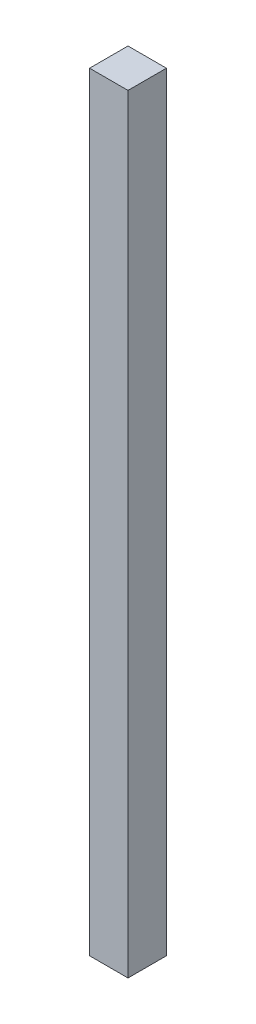
ISO-10303-21;
HEADER;
FILE_DESCRIPTION(('STEP AP214'),'2;1');
FILE_NAME('part.step','',(''),(''),'','','');
FILE_SCHEMA(('AUTOMOTIVE_DESIGN { 1 0 10303 214 1 1 1 1 }'));
ENDSEC;
DATA;
#1=APPLICATION_CONTEXT('core data for automotive mechanical design processes');
#2=APPLICATION_PROTOCOL_DEFINITION('international standard','automotive_design',2000,#1);
#3=PRODUCT_CONTEXT('',#1,'mechanical');
#4=PRODUCT('Part','Part','',(#3));
#5=PRODUCT_RELATED_PRODUCT_CATEGORY('part','',(#4));
#6=PRODUCT_DEFINITION_FORMATION('','',#4);
#7=PRODUCT_DEFINITION_CONTEXT('part definition',#1,'design');
#8=PRODUCT_DEFINITION('design','',#6,#7);
#9=PRODUCT_DEFINITION_SHAPE('','',#8);
#10=(LENGTH_UNIT() NAMED_UNIT(*) SI_UNIT(.MILLI.,.METRE.));
#11=(NAMED_UNIT(*) PLANE_ANGLE_UNIT() SI_UNIT($,.RADIAN.));
#12=(NAMED_UNIT(*) SI_UNIT($,.STERADIAN.) SOLID_ANGLE_UNIT());
#13=UNCERTAINTY_MEASURE_WITH_UNIT(LENGTH_MEASURE(1.E-05),#10,'distance_accuracy_value','');
#14=(GEOMETRIC_REPRESENTATION_CONTEXT(3) GLOBAL_UNCERTAINTY_ASSIGNED_CONTEXT((#13)) GLOBAL_UNIT_ASSIGNED_CONTEXT((#10,
#11,#12)) REPRESENTATION_CONTEXT('',''));
#15=CARTESIAN_POINT('',(0.,0.,0.));
#16=DIRECTION('',(0.,0.,1.));
#17=DIRECTION('',(1.,0.,0.));
#18=AXIS2_PLACEMENT_3D('',#15,#16,#17);
#19=CARTESIAN_POINT('',(20.,800.,20.));
#20=DIRECTION('',(-1.,0.,0.));
#21=DIRECTION('',(0.,0.,1.));
#22=AXIS2_PLACEMENT_3D('',#19,#20,#21);
#23=PLANE('',#22);
#24=DIRECTION('',(0.,0.,-1.));
#25=VECTOR('',#24,1.);
#26=CARTESIAN_POINT('',(20.,0.,20.));
#27=LINE('',#26,#25);
#28=CARTESIAN_POINT('',(20.,0.,20.));
#29=VERTEX_POINT('',#28);
#30=CARTESIAN_POINT('',(20.,0.,-20.));
#31=VERTEX_POINT('',#30);
#32=EDGE_CURVE('E98',#29,#31,#27,.T.);
#33=ORIENTED_EDGE('',*,*,#32,.T.);
#34=DIRECTION('',(0.,-1.,0.));
#35=VECTOR('',#34,1.);
#36=CARTESIAN_POINT('',(20.,800.,-20.));
#37=LINE('',#36,#35);
#38=CARTESIAN_POINT('',(20.,800.,-20.));
#39=VERTEX_POINT('',#38);
#40=EDGE_CURVE('E11',#39,#31,#37,.T.);
#41=ORIENTED_EDGE('',*,*,#40,.F.);
#42=DIRECTION('',(0.,0.,-1.));
#43=VECTOR('',#42,1.);
#44=CARTESIAN_POINT('',(20.,800.,20.));
#45=LINE('',#44,#43);
#46=CARTESIAN_POINT('',(20.,800.,20.));
#47=VERTEX_POINT('',#46);
#48=EDGE_CURVE('E86',#47,#39,#45,.T.);
#49=ORIENTED_EDGE('',*,*,#48,.F.);
#50=DIRECTION('',(0.,-1.,0.));
#51=VECTOR('',#50,1.);
#52=CARTESIAN_POINT('',(20.,800.,20.));
#53=LINE('',#52,#51);
#54=EDGE_CURVE('E94',#47,#29,#53,.T.);
#55=ORIENTED_EDGE('',*,*,#54,.T.);
#56=EDGE_LOOP('',(#33,#41,#49,#55));
#57=FACE_BOUND('',#56,.T.);
#58=ADVANCED_FACE('F35',(#57),#23,.F.);
#59=CARTESIAN_POINT('',(-20.,800.,-20.));
#60=DIRECTION('',(0.,0.,1.));
#61=DIRECTION('',(1.,0.,0.));
#62=AXIS2_PLACEMENT_3D('',#59,#60,#61);
#63=PLANE('',#62);
#64=DIRECTION('',(-1.,0.,0.));
#65=VECTOR('',#64,1.);
#66=CARTESIAN_POINT('',(-20.,0.,-20.));
#67=LINE('',#66,#65);
#68=CARTESIAN_POINT('',(-20.,0.,-20.));
#69=VERTEX_POINT('',#68);
#70=EDGE_CURVE('E90',#31,#69,#67,.T.);
#71=ORIENTED_EDGE('',*,*,#70,.T.);
#72=DIRECTION('',(0.,-1.,0.));
#73=VECTOR('',#72,1.);
#74=CARTESIAN_POINT('',(-20.,800.,-20.));
#75=LINE('',#74,#73);
#76=CARTESIAN_POINT('',(-20.,800.,-20.));
#77=VERTEX_POINT('',#76);
#78=EDGE_CURVE('E43',#77,#69,#75,.T.);
#79=ORIENTED_EDGE('',*,*,#78,.F.);
#80=DIRECTION('',(-1.,0.,0.));
#81=VECTOR('',#80,1.);
#82=CARTESIAN_POINT('',(-20.,800.,-20.));
#83=LINE('',#82,#81);
#84=EDGE_CURVE('E81',#39,#77,#83,.T.);
#85=ORIENTED_EDGE('',*,*,#84,.F.);
#86=ORIENTED_EDGE('',*,*,#40,.T.);
#87=EDGE_LOOP('',(#71,#79,#85,#86));
#88=FACE_BOUND('',#87,.T.);
#89=ADVANCED_FACE('F89',(#88),#63,.F.);
#90=CARTESIAN_POINT('',(-20.,800.,20.));
#91=DIRECTION('',(1.,0.,0.));
#92=DIRECTION('',(0.,0.,-1.));
#93=AXIS2_PLACEMENT_3D('',#90,#91,#92);
#94=PLANE('',#93);
#95=DIRECTION('',(0.,0.,1.));
#96=VECTOR('',#95,1.);
#97=CARTESIAN_POINT('',(-20.,0.,20.));
#98=LINE('',#97,#96);
#99=CARTESIAN_POINT('',(-20.,0.,20.));
#100=VERTEX_POINT('',#99);
#101=EDGE_CURVE('E68',#69,#100,#98,.T.);
#102=ORIENTED_EDGE('',*,*,#101,.T.);
#103=DIRECTION('',(0.,-1.,0.));
#104=VECTOR('',#103,1.);
#105=CARTESIAN_POINT('',(-20.,800.,20.));
#106=LINE('',#105,#104);
#107=CARTESIAN_POINT('',(-20.,800.,20.));
#108=VERTEX_POINT('',#107);
#109=EDGE_CURVE('E91',#108,#100,#106,.T.);
#110=ORIENTED_EDGE('',*,*,#109,.F.);
#111=DIRECTION('',(0.,0.,1.));
#112=VECTOR('',#111,1.);
#113=CARTESIAN_POINT('',(-20.,800.,20.));
#114=LINE('',#113,#112);
#115=EDGE_CURVE('E84',#77,#108,#114,.T.);
#116=ORIENTED_EDGE('',*,*,#115,.F.);
#117=ORIENTED_EDGE('',*,*,#78,.T.);
#118=EDGE_LOOP('',(#102,#110,#116,#117));
#119=FACE_BOUND('',#118,.T.);
#120=ADVANCED_FACE('F92',(#119),#94,.F.);
#121=CARTESIAN_POINT('',(-20.,800.,20.));
#122=DIRECTION('',(0.,0.,-1.));
#123=DIRECTION('',(-1.,0.,0.));
#124=AXIS2_PLACEMENT_3D('',#121,#122,#123);
#125=PLANE('',#124);
#126=DIRECTION('',(1.,0.,0.));
#127=VECTOR('',#126,1.);
#128=CARTESIAN_POINT('',(-20.,0.,20.));
#129=LINE('',#128,#127);
#130=EDGE_CURVE('E74',#100,#29,#129,.T.);
#131=ORIENTED_EDGE('',*,*,#130,.T.);
#132=ORIENTED_EDGE('',*,*,#54,.F.);
#133=DIRECTION('',(1.,0.,0.));
#134=VECTOR('',#133,1.);
#135=CARTESIAN_POINT('',(-20.,800.,20.));
#136=LINE('',#135,#134);
#137=EDGE_CURVE('E51',#108,#47,#136,.T.);
#138=ORIENTED_EDGE('',*,*,#137,.F.);
#139=ORIENTED_EDGE('',*,*,#109,.T.);
#140=EDGE_LOOP('',(#131,#132,#138,#139));
#141=FACE_BOUND('',#140,.T.);
#142=ADVANCED_FACE('F105',(#141),#125,.F.);
#143=CARTESIAN_POINT('',(0.,800.,0.));
#144=DIRECTION('',(0.,-1.,0.));
#145=DIRECTION('',(0.,0.,-1.));
#146=AXIS2_PLACEMENT_3D('',#143,#144,#145);
#147=PLANE('',#146);
#148=ORIENTED_EDGE('',*,*,#48,.T.);
#149=ORIENTED_EDGE('',*,*,#84,.T.);
#150=ORIENTED_EDGE('',*,*,#115,.T.);
#151=ORIENTED_EDGE('',*,*,#137,.T.);
#152=EDGE_LOOP('',(#148,#149,#150,#151));
#153=FACE_BOUND('',#152,.T.);
#154=ADVANCED_FACE('F82',(#153),#147,.F.);
#155=CARTESIAN_POINT('',(0.,0.,0.));
#156=DIRECTION('',(0.,-1.,0.));
#157=DIRECTION('',(0.,0.,-1.));
#158=AXIS2_PLACEMENT_3D('',#155,#156,#157);
#159=PLANE('',#158);
#160=ORIENTED_EDGE('',*,*,#32,.F.);
#161=ORIENTED_EDGE('',*,*,#130,.F.);
#162=ORIENTED_EDGE('',*,*,#101,.F.);
#163=ORIENTED_EDGE('',*,*,#70,.F.);
#164=EDGE_LOOP('',(#160,#161,#162,#163));
#165=FACE_BOUND('',#164,.T.);
#166=ADVANCED_FACE('F108',(#165),#159,.T.);
#167=CLOSED_SHELL('',(#58,#89,#120,#142,#154,#166));
#168=MANIFOLD_SOLID_BREP('B2',#167);
#169=ADVANCED_BREP_SHAPE_REPRESENTATION('',(#18,#168),#14);
#170=SHAPE_DEFINITION_REPRESENTATION(#9,#169);
ENDSEC;
END-ISO-10303-21;
